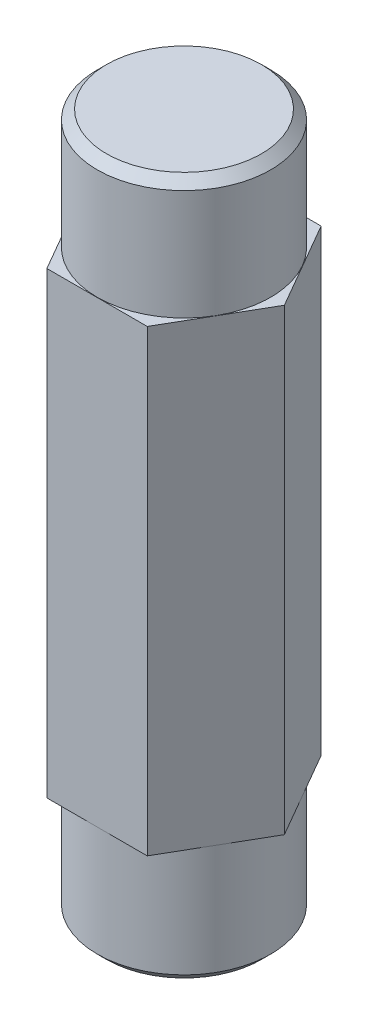
ISO-10303-21;
HEADER;
FILE_DESCRIPTION(('STEP AP214'),'2;1');
FILE_NAME('part.step','',(''),(''),'','','');
FILE_SCHEMA(('AUTOMOTIVE_DESIGN { 1 0 10303 214 1 1 1 1 }'));
ENDSEC;
DATA;
#1=APPLICATION_CONTEXT('core data for automotive mechanical design processes');
#2=APPLICATION_PROTOCOL_DEFINITION('international standard','automotive_design',2000,#1);
#3=PRODUCT_CONTEXT('',#1,'mechanical');
#4=PRODUCT('Part','Part','',(#3));
#5=PRODUCT_RELATED_PRODUCT_CATEGORY('part','',(#4));
#6=PRODUCT_DEFINITION_FORMATION('','',#4);
#7=PRODUCT_DEFINITION_CONTEXT('part definition',#1,'design');
#8=PRODUCT_DEFINITION('design','',#6,#7);
#9=PRODUCT_DEFINITION_SHAPE('','',#8);
#10=(LENGTH_UNIT() NAMED_UNIT(*) SI_UNIT(.MILLI.,.METRE.));
#11=(NAMED_UNIT(*) PLANE_ANGLE_UNIT() SI_UNIT($,.RADIAN.));
#12=(NAMED_UNIT(*) SI_UNIT($,.STERADIAN.) SOLID_ANGLE_UNIT());
#13=UNCERTAINTY_MEASURE_WITH_UNIT(LENGTH_MEASURE(1.E-05),#10,'distance_accuracy_value','');
#14=(GEOMETRIC_REPRESENTATION_CONTEXT(3) GLOBAL_UNCERTAINTY_ASSIGNED_CONTEXT((#13)) GLOBAL_UNIT_ASSIGNED_CONTEXT((#10,
#11,#12)) REPRESENTATION_CONTEXT('',''));
#15=CARTESIAN_POINT('',(0.,0.,0.));
#16=DIRECTION('',(0.,0.,1.));
#17=DIRECTION('',(1.,0.,0.));
#18=AXIS2_PLACEMENT_3D('',#15,#16,#17);
#19=CARTESIAN_POINT('',(-39.2241243202131,6.35,-16.6661167863655));
#20=DIRECTION('',(0.,-1.,0.));
#21=DIRECTION('',(0.,0.,-1.));
#22=AXIS2_PLACEMENT_3D('',#19,#20,#21);
#23=PLANE('',#22);
#24=CARTESIAN_POINT('',(-39.2241243202131,6.34999999994079,-16.6661167863655));
#25=DIRECTION('',(0.,-1.,0.));
#26=DIRECTION('',(0.,0.,-1.));
#27=AXIS2_PLACEMENT_3D('',#24,#25,#26);
#28=CIRCLE('',#27,4.24180000000514);
#29=CARTESIAN_POINT('',(-39.2241243202131,6.34999999994079,-20.9079167863706));
#30=VERTEX_POINT('',#29);
#31=EDGE_CURVE('E21',#30,#30,#28,.T.);
#32=ORIENTED_EDGE('',*,*,#31,.F.);
#33=EDGE_LOOP('',(#32));
#34=FACE_BOUND('',#33,.T.);
#35=ADVANCED_FACE('F18',(#34),#23,.F.);
#36=CARTESIAN_POINT('',(-39.2241243202131,-31.877,-16.6661167863655));
#37=DIRECTION('',(0.,1.,0.));
#38=DIRECTION('',(0.,0.,1.));
#39=AXIS2_PLACEMENT_3D('',#36,#37,#38);
#40=PLANE('',#39);
#41=CARTESIAN_POINT('',(-39.2241243202131,-31.8769999999517,-16.6661167863655));
#42=DIRECTION('',(0.,1.,0.));
#43=DIRECTION('',(0.,0.,1.));
#44=AXIS2_PLACEMENT_3D('',#41,#42,#43);
#45=CIRCLE('',#44,4.24180000002854);
#46=CARTESIAN_POINT('',(-39.2241243202131,-31.8769999999517,-12.4243167863369));
#47=VERTEX_POINT('',#46);
#48=EDGE_CURVE('E110',#47,#47,#45,.T.);
#49=ORIENTED_EDGE('',*,*,#48,.F.);
#50=EDGE_LOOP('',(#49));
#51=FACE_BOUND('',#50,.T.);
#52=ADVANCED_FACE('F122',(#51),#40,.F.);
#53=CARTESIAN_POINT('',(-39.2241243202131,5.8420000000865,-16.6661167863655));
#54=DIRECTION('',(0.,-1.,0.));
#55=DIRECTION('',(0.,0.,-1.));
#56=AXIS2_PLACEMENT_3D('',#53,#54,#55);
#57=CONICAL_SURFACE('',#56,4.74979999991627,0.785398163453397);
#58=CARTESIAN_POINT('',(-39.2241243202131,5.842,-16.6661167863655));
#59=DIRECTION('',(0.,-1.,0.));
#60=DIRECTION('',(0.,0.,-1.));
#61=AXIS2_PLACEMENT_3D('',#58,#59,#60);
#62=CIRCLE('',#61,4.7498);
#63=CARTESIAN_POINT('',(-39.2241243202131,5.842,-21.4159167863655));
#64=VERTEX_POINT('',#63);
#65=EDGE_CURVE('E107',#64,#64,#62,.T.);
#66=ORIENTED_EDGE('',*,*,#65,.F.);
#67=EDGE_LOOP('',(#66));
#68=FACE_BOUND('',#67,.T.);
#69=ORIENTED_EDGE('',*,*,#31,.T.);
#70=EDGE_LOOP('',(#69));
#71=FACE_BOUND('',#70,.T.);
#72=ADVANCED_FACE('F119',(#68,#71),#57,.T.);
#73=CARTESIAN_POINT('',(-39.2241243202131,-31.3689999999838,-16.6661167863655));
#74=DIRECTION('',(0.,1.,0.));
#75=DIRECTION('',(0.,0.,1.));
#76=AXIS2_PLACEMENT_3D('',#73,#74,#75);
#77=CONICAL_SURFACE('',#76,4.74980000005336,0.785398163453397);
#78=CARTESIAN_POINT('',(-39.2241243202131,-31.369,-16.6661167863655));
#79=DIRECTION('',(0.,1.,0.));
#80=DIRECTION('',(0.,0.,1.));
#81=AXIS2_PLACEMENT_3D('',#78,#79,#80);
#82=CIRCLE('',#81,4.7498);
#83=CARTESIAN_POINT('',(-39.2241243202131,-31.369,-11.9163167863655));
#84=VERTEX_POINT('',#83);
#85=EDGE_CURVE('E80',#84,#84,#82,.T.);
#86=ORIENTED_EDGE('',*,*,#85,.F.);
#87=EDGE_LOOP('',(#86));
#88=FACE_BOUND('',#87,.T.);
#89=ORIENTED_EDGE('',*,*,#48,.T.);
#90=EDGE_LOOP('',(#89));
#91=FACE_BOUND('',#90,.T.);
#92=ADVANCED_FACE('F163',(#88,#91),#77,.T.);
#93=CARTESIAN_POINT('',(-39.2241243202131,6.35,-16.6661167863655));
#94=DIRECTION('',(0.,-1.,0.));
#95=DIRECTION('',(0.,0.,-1.));
#96=AXIS2_PLACEMENT_3D('',#93,#94,#95);
#97=CYLINDRICAL_SURFACE('',#96,4.7498);
#98=CARTESIAN_POINT('',(-39.2241243202131,-0.2032,-16.6661167863655));
#99=DIRECTION('',(0.,-1.,0.));
#100=DIRECTION('',(0.,0.,-1.));
#101=AXIS2_PLACEMENT_3D('',#98,#99,#100);
#102=CIRCLE('',#101,4.7498);
#103=CARTESIAN_POINT('',(-39.2241243202131,-0.2032,-21.4159167863655));
#104=VERTEX_POINT('',#103);
#105=EDGE_CURVE('E96',#104,#104,#102,.T.);
#106=ORIENTED_EDGE('',*,*,#105,.F.);
#107=EDGE_LOOP('',(#106));
#108=FACE_BOUND('',#107,.T.);
#109=ORIENTED_EDGE('',*,*,#65,.T.);
#110=EDGE_LOOP('',(#109));
#111=FACE_BOUND('',#110,.T.);
#112=ADVANCED_FACE('F159',(#108,#111),#97,.T.);
#113=CARTESIAN_POINT('',(-39.2241243202131,-31.877,-16.6661167863655));
#114=DIRECTION('',(0.,1.,0.));
#115=DIRECTION('',(0.,0.,1.));
#116=AXIS2_PLACEMENT_3D('',#113,#114,#115);
#117=CYLINDRICAL_SURFACE('',#116,4.7498);
#118=CARTESIAN_POINT('',(-39.2241243202131,-25.3238,-16.6661167863655));
#119=DIRECTION('',(0.,1.,0.));
#120=DIRECTION('',(0.,0.,1.));
#121=AXIS2_PLACEMENT_3D('',#118,#119,#120);
#122=CIRCLE('',#121,4.7498);
#123=CARTESIAN_POINT('',(-39.2241243202131,-25.3238,-11.9163167863655));
#124=VERTEX_POINT('',#123);
#125=EDGE_CURVE('E111',#124,#124,#122,.T.);
#126=ORIENTED_EDGE('',*,*,#125,.F.);
#127=EDGE_LOOP('',(#126));
#128=FACE_BOUND('',#127,.T.);
#129=ORIENTED_EDGE('',*,*,#85,.T.);
#130=EDGE_LOOP('',(#129));
#131=FACE_BOUND('',#130,.T.);
#132=ADVANCED_FACE('F156',(#128,#131),#117,.T.);
#133=CARTESIAN_POINT('',(-44.7233856342443,-25.527,-16.6661167863655));
#134=DIRECTION('',(-0.866025403784439,0.,0.5));
#135=DIRECTION('',(0.5,0.,0.866025403784439));
#136=AXIS2_PLACEMENT_3D('',#133,#134,#135);
#137=PLANE('',#136);
#138=DIRECTION('',(0.,1.,0.));
#139=VECTOR('',#138,1.);
#140=CARTESIAN_POINT('',(-44.7233856342443,-25.527,-16.6661167863655));
#141=LINE('',#140,#139);
#142=CARTESIAN_POINT('',(-44.7233856342443,-25.3238,-16.6661167863655));
#143=VERTEX_POINT('',#142);
#144=CARTESIAN_POINT('',(-44.7233856342443,-0.2032,-16.6661167863655));
#145=VERTEX_POINT('',#144);
#146=EDGE_CURVE('E71',#143,#145,#141,.T.);
#147=ORIENTED_EDGE('',*,*,#146,.F.);
#148=DIRECTION('',(-0.5,0.,-0.866025403784439));
#149=VECTOR('',#148,1.);
#150=CARTESIAN_POINT('',(-41.9737549772287,-25.3238,-11.9036167863655));
#151=LINE('',#150,#149);
#152=CARTESIAN_POINT('',(-41.9737549772287,-25.3238,-11.9036167863655));
#153=VERTEX_POINT('',#152);
#154=EDGE_CURVE('E278',#153,#143,#151,.T.);
#155=ORIENTED_EDGE('',*,*,#154,.F.);
#156=DIRECTION('',(0.,1.,0.));
#157=VECTOR('',#156,1.);
#158=CARTESIAN_POINT('',(-41.9737549772287,-25.527,-11.9036167863655));
#159=LINE('',#158,#157);
#160=CARTESIAN_POINT('',(-41.9737549772287,-0.2032,-11.9036167863655));
#161=VERTEX_POINT('',#160);
#162=EDGE_CURVE('E85',#161,#153,#159,.F.);
#163=ORIENTED_EDGE('',*,*,#162,.F.);
#164=DIRECTION('',(0.5,0.,0.866025403784439));
#165=VECTOR('',#164,1.);
#166=CARTESIAN_POINT('',(-44.7233856342443,-0.2032,-16.6661167863655));
#167=LINE('',#166,#165);
#168=EDGE_CURVE('E83',#145,#161,#167,.T.);
#169=ORIENTED_EDGE('',*,*,#168,.F.);
#170=EDGE_LOOP('',(#147,#155,#163,#169));
#171=FACE_BOUND('',#170,.T.);
#172=ADVANCED_FACE('F84',(#171),#137,.T.);
#173=CARTESIAN_POINT('',(-41.9737549772287,-25.527,-21.4286167863655));
#174=DIRECTION('',(-0.866025403784438,0.,-0.500000000000001));
#175=DIRECTION('',(-0.500000000000001,0.,0.866025403784438));
#176=AXIS2_PLACEMENT_3D('',#173,#174,#175);
#177=PLANE('',#176);
#178=DIRECTION('',(0.,1.,0.));
#179=VECTOR('',#178,1.);
#180=CARTESIAN_POINT('',(-41.9737549772287,-25.527,-21.4286167863655));
#181=LINE('',#180,#179);
#182=CARTESIAN_POINT('',(-41.9737549772287,-25.3238,-21.4286167863655));
#183=VERTEX_POINT('',#182);
#184=CARTESIAN_POINT('',(-41.9737549772287,-0.2032,-21.4286167863655));
#185=VERTEX_POINT('',#184);
#186=EDGE_CURVE('E79',#183,#185,#181,.T.);
#187=ORIENTED_EDGE('',*,*,#186,.F.);
#188=DIRECTION('',(0.500000000000001,0.,-0.866025403784438));
#189=VECTOR('',#188,1.);
#190=CARTESIAN_POINT('',(-44.7233856342443,-25.3238,-16.6661167863655));
#191=LINE('',#190,#189);
#192=EDGE_CURVE('E75',#143,#183,#191,.T.);
#193=ORIENTED_EDGE('',*,*,#192,.F.);
#194=ORIENTED_EDGE('',*,*,#146,.T.);
#195=DIRECTION('',(-0.500000000000001,0.,0.866025403784438));
#196=VECTOR('',#195,1.);
#197=CARTESIAN_POINT('',(-41.9737549772287,-0.2032,-21.4286167863655));
#198=LINE('',#197,#196);
#199=EDGE_CURVE('E68',#185,#145,#198,.T.);
#200=ORIENTED_EDGE('',*,*,#199,.F.);
#201=EDGE_LOOP('',(#187,#193,#194,#200));
#202=FACE_BOUND('',#201,.T.);
#203=ADVANCED_FACE('F73',(#202),#177,.T.);
#204=CARTESIAN_POINT('',(-36.4744936631975,-25.527,-21.4286167863655));
#205=DIRECTION('',(0.,0.,-1.));
#206=DIRECTION('',(-1.,0.,0.));
#207=AXIS2_PLACEMENT_3D('',#204,#205,#206);
#208=PLANE('',#207);
#209=DIRECTION('',(0.,1.,0.));
#210=VECTOR('',#209,1.);
#211=CARTESIAN_POINT('',(-36.4744936631975,-25.527,-21.4286167863655));
#212=LINE('',#211,#210);
#213=CARTESIAN_POINT('',(-36.4744936631975,-25.3238,-21.4286167863655));
#214=VERTEX_POINT('',#213);
#215=CARTESIAN_POINT('',(-36.4744936631975,-0.2032,-21.4286167863655));
#216=VERTEX_POINT('',#215);
#217=EDGE_CURVE('E99',#214,#216,#212,.T.);
#218=ORIENTED_EDGE('',*,*,#217,.F.);
#219=DIRECTION('',(1.,0.,0.));
#220=VECTOR('',#219,1.);
#221=CARTESIAN_POINT('',(-41.9737549772287,-25.3238,-21.4286167863655));
#222=LINE('',#221,#220);
#223=EDGE_CURVE('E271',#183,#214,#222,.T.);
#224=ORIENTED_EDGE('',*,*,#223,.F.);
#225=ORIENTED_EDGE('',*,*,#186,.T.);
#226=DIRECTION('',(1.,0.,0.));
#227=VECTOR('',#226,1.);
#228=CARTESIAN_POINT('',(-44.7233856342443,-0.2032,-21.4286167863655));
#229=LINE('',#228,#227);
#230=EDGE_CURVE('E95',#216,#185,#229,.F.);
#231=ORIENTED_EDGE('',*,*,#230,.F.);
#232=EDGE_LOOP('',(#218,#224,#225,#231));
#233=FACE_BOUND('',#232,.T.);
#234=ADVANCED_FACE('F147',(#233),#208,.T.);
#235=CARTESIAN_POINT('',(-33.7248630061819,-25.527,-16.6661167863655));
#236=DIRECTION('',(0.866025403784439,0.,-0.5));
#237=DIRECTION('',(-0.5,0.,-0.866025403784439));
#238=AXIS2_PLACEMENT_3D('',#235,#236,#237);
#239=PLANE('',#238);
#240=DIRECTION('',(0.,1.,0.));
#241=VECTOR('',#240,1.);
#242=CARTESIAN_POINT('',(-33.7248630061819,-25.527,-16.6661167863655));
#243=LINE('',#242,#241);
#244=CARTESIAN_POINT('',(-33.7248630061819,-25.3238,-16.6661167863655));
#245=VERTEX_POINT('',#244);
#246=CARTESIAN_POINT('',(-33.7248630061819,-0.2032,-16.6661167863655));
#247=VERTEX_POINT('',#246);
#248=EDGE_CURVE('E275',#245,#247,#243,.T.);
#249=ORIENTED_EDGE('',*,*,#248,.F.);
#250=DIRECTION('',(0.5,0.,0.866025403784439));
#251=VECTOR('',#250,1.);
#252=CARTESIAN_POINT('',(-36.4744936631975,-25.3238,-21.4286167863655));
#253=LINE('',#252,#251);
#254=EDGE_CURVE('E273',#214,#245,#253,.T.);
#255=ORIENTED_EDGE('',*,*,#254,.F.);
#256=ORIENTED_EDGE('',*,*,#217,.T.);
#257=DIRECTION('',(-0.5,0.,-0.866025403784439));
#258=VECTOR('',#257,1.);
#259=CARTESIAN_POINT('',(-33.7248630061819,-0.2032,-16.6661167863655));
#260=LINE('',#259,#258);
#261=EDGE_CURVE('E88',#247,#216,#260,.T.);
#262=ORIENTED_EDGE('',*,*,#261,.F.);
#263=EDGE_LOOP('',(#249,#255,#256,#262));
#264=FACE_BOUND('',#263,.T.);
#265=ADVANCED_FACE('F144',(#264),#239,.T.);
#266=CARTESIAN_POINT('',(-44.7233856342443,-0.2032,-16.6661167863655));
#267=DIRECTION('',(0.,1.,0.));
#268=DIRECTION('',(0.,0.,1.));
#269=AXIS2_PLACEMENT_3D('',#266,#267,#268);
#270=PLANE('',#269);
#271=ORIENTED_EDGE('',*,*,#261,.T.);
#272=ORIENTED_EDGE('',*,*,#230,.T.);
#273=ORIENTED_EDGE('',*,*,#199,.T.);
#274=ORIENTED_EDGE('',*,*,#168,.T.);
#275=DIRECTION('',(1.,0.,0.));
#276=VECTOR('',#275,1.);
#277=CARTESIAN_POINT('',(-41.9737549772287,-0.203200000000001,-11.9036167863655));
#278=LINE('',#277,#276);
#279=CARTESIAN_POINT('',(-36.4744936631975,-0.2032,-11.9036167863655));
#280=VERTEX_POINT('',#279);
#281=EDGE_CURVE('E285',#280,#161,#278,.F.);
#282=ORIENTED_EDGE('',*,*,#281,.F.);
#283=DIRECTION('',(0.500000000000001,0.,-0.866025403784438));
#284=VECTOR('',#283,1.);
#285=CARTESIAN_POINT('',(-36.4744936631975,-0.203200000000001,-11.9036167863655));
#286=LINE('',#285,#284);
#287=EDGE_CURVE('E289',#247,#280,#286,.F.);
#288=ORIENTED_EDGE('',*,*,#287,.F.);
#289=EDGE_LOOP('',(#271,#272,#273,#274,#282,#288));
#290=FACE_BOUND('',#289,.T.);
#291=ORIENTED_EDGE('',*,*,#105,.T.);
#292=EDGE_LOOP('',(#291));
#293=FACE_BOUND('',#292,.T.);
#294=ADVANCED_FACE('F92',(#290,#293),#270,.T.);
#295=CARTESIAN_POINT('',(-41.9737549772287,-25.527,-11.9036167863655));
#296=DIRECTION('',(0.,0.,1.));
#297=DIRECTION('',(1.,0.,0.));
#298=AXIS2_PLACEMENT_3D('',#295,#296,#297);
#299=PLANE('',#298);
#300=ORIENTED_EDGE('',*,*,#162,.T.);
#301=DIRECTION('',(1.,0.,0.));
#302=VECTOR('',#301,1.);
#303=CARTESIAN_POINT('',(-41.9737549772287,-25.3238,-11.9036167863655));
#304=LINE('',#303,#302);
#305=CARTESIAN_POINT('',(-36.4744936631975,-25.3238,-11.9036167863655));
#306=VERTEX_POINT('',#305);
#307=EDGE_CURVE('E36',#306,#153,#304,.F.);
#308=ORIENTED_EDGE('',*,*,#307,.F.);
#309=DIRECTION('',(0.,1.,0.));
#310=VECTOR('',#309,1.);
#311=CARTESIAN_POINT('',(-36.4744936631975,-25.527,-11.9036167863655));
#312=LINE('',#311,#310);
#313=EDGE_CURVE('E27',#280,#306,#312,.F.);
#314=ORIENTED_EDGE('',*,*,#313,.F.);
#315=ORIENTED_EDGE('',*,*,#281,.T.);
#316=EDGE_LOOP('',(#300,#308,#314,#315));
#317=FACE_BOUND('',#316,.T.);
#318=ADVANCED_FACE('F135',(#317),#299,.T.);
#319=CARTESIAN_POINT('',(-41.9737549772287,-25.3238,-11.9036167863655));
#320=DIRECTION('',(0.,-1.,0.));
#321=DIRECTION('',(0.,0.,-1.));
#322=AXIS2_PLACEMENT_3D('',#319,#320,#321);
#323=PLANE('',#322);
#324=ORIENTED_EDGE('',*,*,#254,.T.);
#325=DIRECTION('',(0.500000000000001,0.,-0.866025403784438));
#326=VECTOR('',#325,1.);
#327=CARTESIAN_POINT('',(-36.4744936631975,-25.3238,-11.9036167863655));
#328=LINE('',#327,#326);
#329=EDGE_CURVE('E11',#306,#245,#328,.T.);
#330=ORIENTED_EDGE('',*,*,#329,.F.);
#331=ORIENTED_EDGE('',*,*,#307,.T.);
#332=ORIENTED_EDGE('',*,*,#154,.T.);
#333=ORIENTED_EDGE('',*,*,#192,.T.);
#334=ORIENTED_EDGE('',*,*,#223,.T.);
#335=EDGE_LOOP('',(#324,#330,#331,#332,#333,#334));
#336=FACE_BOUND('',#335,.T.);
#337=ORIENTED_EDGE('',*,*,#125,.T.);
#338=EDGE_LOOP('',(#337));
#339=FACE_BOUND('',#338,.T.);
#340=ADVANCED_FACE('F129',(#336,#339),#323,.T.);
#341=CARTESIAN_POINT('',(-36.4744936631975,-25.527,-11.9036167863655));
#342=DIRECTION('',(0.866025403784438,0.,0.500000000000001));
#343=DIRECTION('',(0.500000000000001,0.,-0.866025403784438));
#344=AXIS2_PLACEMENT_3D('',#341,#342,#343);
#345=PLANE('',#344);
#346=ORIENTED_EDGE('',*,*,#313,.T.);
#347=ORIENTED_EDGE('',*,*,#329,.T.);
#348=ORIENTED_EDGE('',*,*,#248,.T.);
#349=ORIENTED_EDGE('',*,*,#287,.T.);
#350=EDGE_LOOP('',(#346,#347,#348,#349));
#351=FACE_BOUND('',#350,.T.);
#352=ADVANCED_FACE('F127',(#351),#345,.T.);
#353=CLOSED_SHELL('',(#35,#52,#72,#92,#112,#132,#172,#203,#234,#265,#294,#318,#340,#352));
#354=MANIFOLD_SOLID_BREP('B1',#353);
#355=ADVANCED_BREP_SHAPE_REPRESENTATION('',(#18,#354),#14);
#356=SHAPE_DEFINITION_REPRESENTATION(#9,#355);
ENDSEC;
END-ISO-10303-21;
